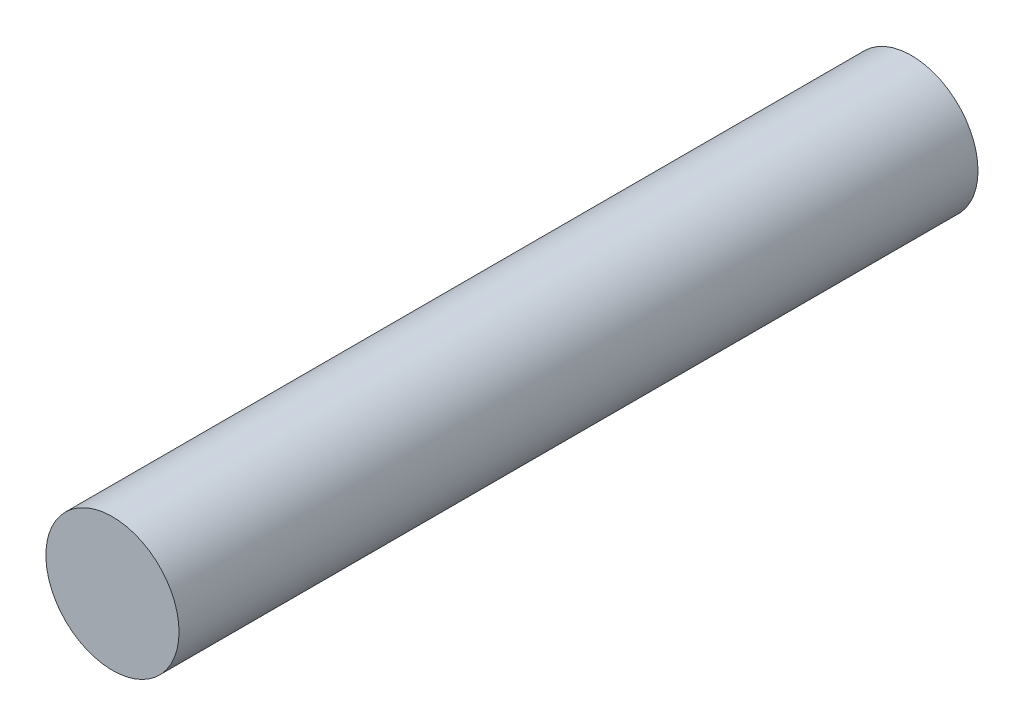
ISO-10303-21;
HEADER;
FILE_DESCRIPTION(('STEP AP214'),'2;1');
FILE_NAME('part.step','',(''),(''),'','','');
FILE_SCHEMA(('AUTOMOTIVE_DESIGN { 1 0 10303 214 1 1 1 1 }'));
ENDSEC;
DATA;
#1=APPLICATION_CONTEXT('core data for automotive mechanical design processes');
#2=APPLICATION_PROTOCOL_DEFINITION('international standard','automotive_design',2000,#1);
#3=PRODUCT_CONTEXT('',#1,'mechanical');
#4=PRODUCT('Part','Part','',(#3));
#5=PRODUCT_RELATED_PRODUCT_CATEGORY('part','',(#4));
#6=PRODUCT_DEFINITION_FORMATION('','',#4);
#7=PRODUCT_DEFINITION_CONTEXT('part definition',#1,'design');
#8=PRODUCT_DEFINITION('design','',#6,#7);
#9=PRODUCT_DEFINITION_SHAPE('','',#8);
#10=(LENGTH_UNIT() NAMED_UNIT(*) SI_UNIT(.MILLI.,.METRE.));
#11=(NAMED_UNIT(*) PLANE_ANGLE_UNIT() SI_UNIT($,.RADIAN.));
#12=(NAMED_UNIT(*) SI_UNIT($,.STERADIAN.) SOLID_ANGLE_UNIT());
#13=UNCERTAINTY_MEASURE_WITH_UNIT(LENGTH_MEASURE(1.E-05),#10,'distance_accuracy_value','');
#14=(GEOMETRIC_REPRESENTATION_CONTEXT(3) GLOBAL_UNCERTAINTY_ASSIGNED_CONTEXT((#13)) GLOBAL_UNIT_ASSIGNED_CONTEXT((#10,
#11,#12)) REPRESENTATION_CONTEXT('',''));
#15=CARTESIAN_POINT('',(0.,0.,0.));
#16=DIRECTION('',(0.,0.,1.));
#17=DIRECTION('',(1.,0.,0.));
#18=AXIS2_PLACEMENT_3D('',#15,#16,#17);
#19=CARTESIAN_POINT('',(0.,0.,19.05));
#20=DIRECTION('',(0.,0.,-1.));
#21=DIRECTION('',(-1.,0.,0.));
#22=AXIS2_PLACEMENT_3D('',#19,#20,#21);
#23=CYLINDRICAL_SURFACE('',#22,1.5875);
#24=CARTESIAN_POINT('',(0.,0.,19.05));
#25=DIRECTION('',(0.,0.,1.));
#26=DIRECTION('',(1.,0.,0.));
#27=AXIS2_PLACEMENT_3D('',#24,#25,#26);
#28=CIRCLE('',#27,1.5875);
#29=CARTESIAN_POINT('',(1.5875,0.,19.05));
#30=VERTEX_POINT('',#29);
#31=EDGE_CURVE('E10',#30,#30,#28,.T.);
#32=ORIENTED_EDGE('',*,*,#31,.F.);
#33=EDGE_LOOP('',(#32));
#34=FACE_BOUND('',#33,.T.);
#35=CARTESIAN_POINT('',(0.,0.,0.));
#36=DIRECTION('',(0.,0.,1.));
#37=DIRECTION('',(1.,0.,0.));
#38=AXIS2_PLACEMENT_3D('',#35,#36,#37);
#39=CIRCLE('',#38,1.5875);
#40=CARTESIAN_POINT('',(1.5875,0.,0.));
#41=VERTEX_POINT('',#40);
#42=EDGE_CURVE('E34',#41,#41,#39,.T.);
#43=ORIENTED_EDGE('',*,*,#42,.T.);
#44=EDGE_LOOP('',(#43));
#45=FACE_BOUND('',#44,.T.);
#46=ADVANCED_FACE('F31',(#34,#45),#23,.T.);
#47=CARTESIAN_POINT('',(0.,0.,19.05));
#48=DIRECTION('',(0.,0.,1.));
#49=DIRECTION('',(1.,0.,0.));
#50=AXIS2_PLACEMENT_3D('',#47,#48,#49);
#51=PLANE('',#50);
#52=ORIENTED_EDGE('',*,*,#31,.T.);
#53=EDGE_LOOP('',(#52));
#54=FACE_BOUND('',#53,.T.);
#55=ADVANCED_FACE('F46',(#54),#51,.T.);
#56=CARTESIAN_POINT('',(0.,0.,0.));
#57=DIRECTION('',(0.,0.,1.));
#58=DIRECTION('',(1.,0.,0.));
#59=AXIS2_PLACEMENT_3D('',#56,#57,#58);
#60=PLANE('',#59);
#61=ORIENTED_EDGE('',*,*,#42,.F.);
#62=EDGE_LOOP('',(#61));
#63=FACE_BOUND('',#62,.T.);
#64=ADVANCED_FACE('F44',(#63),#60,.F.);
#65=CLOSED_SHELL('',(#46,#55,#64));
#66=MANIFOLD_SOLID_BREP('B2',#65);
#67=ADVANCED_BREP_SHAPE_REPRESENTATION('',(#18,#66),#14);
#68=SHAPE_DEFINITION_REPRESENTATION(#9,#67);
ENDSEC;
END-ISO-10303-21;
